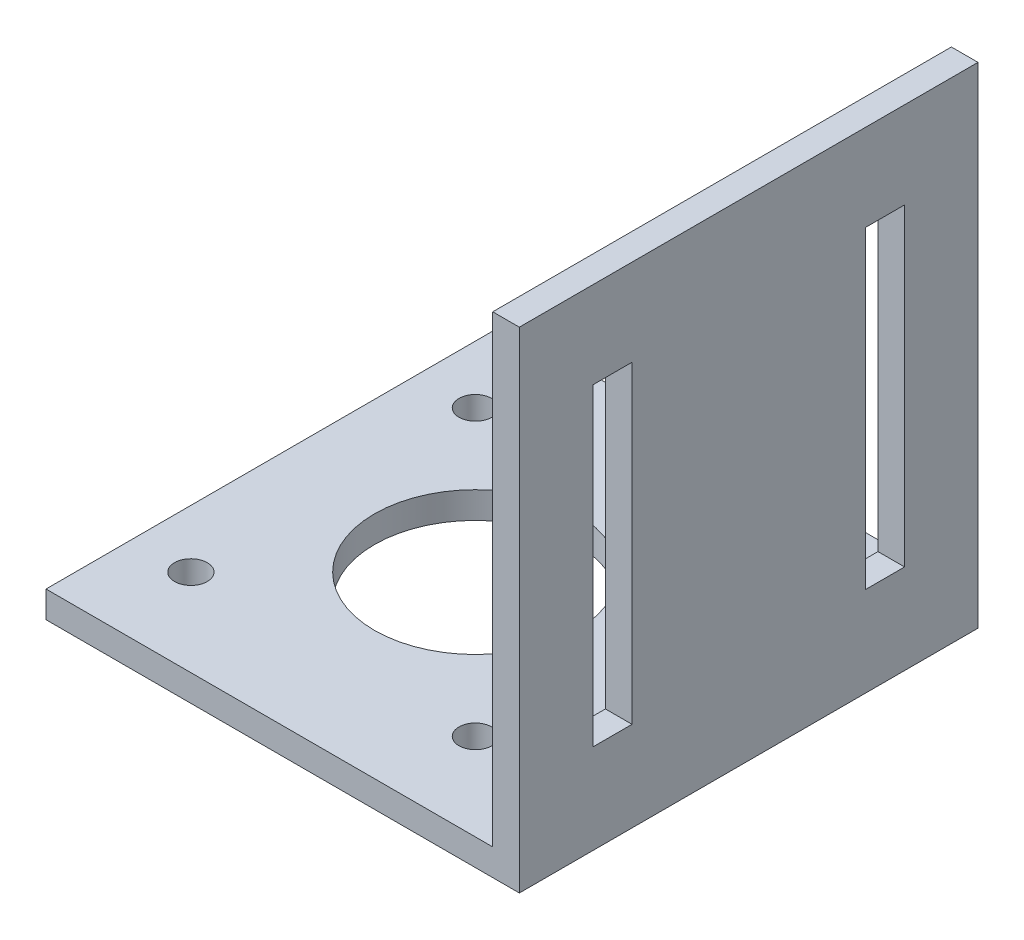
ISO-10303-21;
HEADER;
FILE_DESCRIPTION(('STEP AP214'),'2;1');
FILE_NAME('part.step','',(''),(''),'','','');
FILE_SCHEMA(('AUTOMOTIVE_DESIGN { 1 0 10303 214 1 1 1 1 }'));
ENDSEC;
DATA;
#1=APPLICATION_CONTEXT('core data for automotive mechanical design processes');
#2=APPLICATION_PROTOCOL_DEFINITION('international standard','automotive_design',2000,#1);
#3=PRODUCT_CONTEXT('',#1,'mechanical');
#4=PRODUCT('Part','Part','',(#3));
#5=PRODUCT_RELATED_PRODUCT_CATEGORY('part','',(#4));
#6=PRODUCT_DEFINITION_FORMATION('','',#4);
#7=PRODUCT_DEFINITION_CONTEXT('part definition',#1,'design');
#8=PRODUCT_DEFINITION('design','',#6,#7);
#9=PRODUCT_DEFINITION_SHAPE('','',#8);
#10=(LENGTH_UNIT() NAMED_UNIT(*) SI_UNIT(.MILLI.,.METRE.));
#11=(NAMED_UNIT(*) PLANE_ANGLE_UNIT() SI_UNIT($,.RADIAN.));
#12=(NAMED_UNIT(*) SI_UNIT($,.STERADIAN.) SOLID_ANGLE_UNIT());
#13=UNCERTAINTY_MEASURE_WITH_UNIT(LENGTH_MEASURE(1.E-05),#10,'distance_accuracy_value','');
#14=(GEOMETRIC_REPRESENTATION_CONTEXT(3) GLOBAL_UNCERTAINTY_ASSIGNED_CONTEXT((#13)) GLOBAL_UNIT_ASSIGNED_CONTEXT((#10,
#11,#12)) REPRESENTATION_CONTEXT('',''));
#15=CARTESIAN_POINT('',(0.,0.,0.));
#16=DIRECTION('',(0.,0.,1.));
#17=DIRECTION('',(1.,0.,0.));
#18=AXIS2_PLACEMENT_3D('',#15,#16,#17);
#19=CARTESIAN_POINT('',(0.,2.9,0.));
#20=DIRECTION('',(0.,-1.,0.));
#21=DIRECTION('',(0.,0.,-1.));
#22=AXIS2_PLACEMENT_3D('',#19,#20,#21);
#23=PLANE('',#22);
#24=CARTESIAN_POINT('',(6.3,2.9,-9.49));
#25=DIRECTION('',(0.,-1.,0.));
#26=DIRECTION('',(0.,0.,-1.));
#27=AXIS2_PLACEMENT_3D('',#24,#25,#26);
#28=CIRCLE('',#27,1.785);
#29=CARTESIAN_POINT('',(6.3,2.9,-11.275));
#30=VERTEX_POINT('',#29);
#31=EDGE_CURVE('E169',#30,#30,#28,.T.);
#32=ORIENTED_EDGE('',*,*,#31,.T.);
#33=EDGE_LOOP('',(#32));
#34=FACE_BOUND('',#33,.T.);
#35=CARTESIAN_POINT('',(37.3,2.9,-9.49));
#36=DIRECTION('',(0.,-1.,0.));
#37=DIRECTION('',(0.,0.,-1.));
#38=AXIS2_PLACEMENT_3D('',#35,#36,#37);
#39=CIRCLE('',#38,1.785);
#40=CARTESIAN_POINT('',(37.3,2.9,-11.275));
#41=VERTEX_POINT('',#40);
#42=EDGE_CURVE('E439',#41,#41,#39,.T.);
#43=ORIENTED_EDGE('',*,*,#42,.T.);
#44=EDGE_LOOP('',(#43));
#45=FACE_BOUND('',#44,.T.);
#46=CARTESIAN_POINT('',(37.3,2.9,-40.49));
#47=DIRECTION('',(0.,-1.,0.));
#48=DIRECTION('',(0.,0.,-1.));
#49=AXIS2_PLACEMENT_3D('',#46,#47,#48);
#50=CIRCLE('',#49,1.785);
#51=CARTESIAN_POINT('',(37.3,2.9,-42.275));
#52=VERTEX_POINT('',#51);
#53=EDGE_CURVE('E442',#52,#52,#50,.T.);
#54=ORIENTED_EDGE('',*,*,#53,.T.);
#55=EDGE_LOOP('',(#54));
#56=FACE_BOUND('',#55,.T.);
#57=CARTESIAN_POINT('',(6.3,2.9,-40.49));
#58=DIRECTION('',(0.,-1.,0.));
#59=DIRECTION('',(0.,0.,-1.));
#60=AXIS2_PLACEMENT_3D('',#57,#58,#59);
#61=CIRCLE('',#60,1.785);
#62=CARTESIAN_POINT('',(6.3,2.9,-42.275));
#63=VERTEX_POINT('',#62);
#64=EDGE_CURVE('E447',#63,#63,#61,.T.);
#65=ORIENTED_EDGE('',*,*,#64,.T.);
#66=EDGE_LOOP('',(#65));
#67=FACE_BOUND('',#66,.T.);
#68=CARTESIAN_POINT('',(21.8,2.9,-24.99));
#69=DIRECTION('',(0.,-1.,0.));
#70=DIRECTION('',(0.,0.,-1.));
#71=AXIS2_PLACEMENT_3D('',#68,#69,#70);
#72=CIRCLE('',#71,11.);
#73=CARTESIAN_POINT('',(21.8,2.9,-35.99));
#74=VERTEX_POINT('',#73);
#75=EDGE_CURVE('E450',#74,#74,#72,.T.);
#76=ORIENTED_EDGE('',*,*,#75,.T.);
#77=EDGE_LOOP('',(#76));
#78=FACE_BOUND('',#77,.T.);
#79=DIRECTION('',(0.,0.,1.));
#80=VECTOR('',#79,1.);
#81=CARTESIAN_POINT('',(48.68,2.9,0.));
#82=LINE('',#81,#80);
#83=CARTESIAN_POINT('',(48.68,2.9,-49.98));
#84=VERTEX_POINT('',#83);
#85=CARTESIAN_POINT('',(48.68,2.9,0.));
#86=VERTEX_POINT('',#85);
#87=EDGE_CURVE('E164',#84,#86,#82,.T.);
#88=ORIENTED_EDGE('',*,*,#87,.F.);
#89=DIRECTION('',(-1.,0.,0.));
#90=VECTOR('',#89,1.);
#91=CARTESIAN_POINT('',(0.,2.9,-49.98));
#92=LINE('',#91,#90);
#93=CARTESIAN_POINT('',(0.,2.9,-49.98));
#94=VERTEX_POINT('',#93);
#95=EDGE_CURVE('E211',#84,#94,#92,.T.);
#96=ORIENTED_EDGE('',*,*,#95,.T.);
#97=DIRECTION('',(0.,0.,1.));
#98=VECTOR('',#97,1.);
#99=CARTESIAN_POINT('',(0.,2.9,0.));
#100=LINE('',#99,#98);
#101=CARTESIAN_POINT('',(0.,2.9,0.));
#102=VERTEX_POINT('',#101);
#103=EDGE_CURVE('E205',#94,#102,#100,.T.);
#104=ORIENTED_EDGE('',*,*,#103,.T.);
#105=DIRECTION('',(1.,0.,0.));
#106=VECTOR('',#105,1.);
#107=CARTESIAN_POINT('',(0.,2.9,0.));
#108=LINE('',#107,#106);
#109=EDGE_CURVE('E208',#102,#86,#108,.T.);
#110=ORIENTED_EDGE('',*,*,#109,.T.);
#111=EDGE_LOOP('',(#88,#96,#104,#110));
#112=FACE_BOUND('',#111,.T.);
#113=ADVANCED_FACE('F32',(#34,#45,#56,#67,#78,#112),#23,.F.);
#114=CARTESIAN_POINT('',(0.,2.9,0.));
#115=DIRECTION('',(1.,0.,0.));
#116=DIRECTION('',(0.,0.,-1.));
#117=AXIS2_PLACEMENT_3D('',#114,#115,#116);
#118=PLANE('',#117);
#119=DIRECTION('',(0.,0.,1.));
#120=VECTOR('',#119,1.);
#121=CARTESIAN_POINT('',(0.,0.,0.));
#122=LINE('',#121,#120);
#123=CARTESIAN_POINT('',(0.,0.,-49.98));
#124=VERTEX_POINT('',#123);
#125=CARTESIAN_POINT('',(0.,0.,0.));
#126=VERTEX_POINT('',#125);
#127=EDGE_CURVE('E204',#124,#126,#122,.T.);
#128=ORIENTED_EDGE('',*,*,#127,.T.);
#129=DIRECTION('',(0.,-1.,0.));
#130=VECTOR('',#129,1.);
#131=CARTESIAN_POINT('',(0.,2.9,0.));
#132=LINE('',#131,#130);
#133=EDGE_CURVE('E229',#102,#126,#132,.T.);
#134=ORIENTED_EDGE('',*,*,#133,.F.);
#135=ORIENTED_EDGE('',*,*,#103,.F.);
#136=DIRECTION('',(0.,-1.,0.));
#137=VECTOR('',#136,1.);
#138=CARTESIAN_POINT('',(0.,2.9,-49.98));
#139=LINE('',#138,#137);
#140=EDGE_CURVE('E213',#94,#124,#139,.T.);
#141=ORIENTED_EDGE('',*,*,#140,.T.);
#142=EDGE_LOOP('',(#128,#134,#135,#141));
#143=FACE_BOUND('',#142,.T.);
#144=ADVANCED_FACE('F34',(#143),#118,.F.);
#145=CARTESIAN_POINT('',(0.,2.9,0.));
#146=DIRECTION('',(0.,0.,-1.));
#147=DIRECTION('',(-1.,0.,0.));
#148=AXIS2_PLACEMENT_3D('',#145,#146,#147);
#149=PLANE('',#148);
#150=DIRECTION('',(1.,0.,0.));
#151=VECTOR('',#150,1.);
#152=CARTESIAN_POINT('',(0.,0.,0.));
#153=LINE('',#152,#151);
#154=CARTESIAN_POINT('',(51.58,0.,0.));
#155=VERTEX_POINT('',#154);
#156=EDGE_CURVE('E216',#126,#155,#153,.T.);
#157=ORIENTED_EDGE('',*,*,#156,.T.);
#158=DIRECTION('',(0.,-1.,0.));
#159=VECTOR('',#158,1.);
#160=CARTESIAN_POINT('',(51.58,2.9,0.));
#161=LINE('',#160,#159);
#162=CARTESIAN_POINT('',(51.58,53.4,0.));
#163=VERTEX_POINT('',#162);
#164=EDGE_CURVE('E226',#163,#155,#161,.T.);
#165=ORIENTED_EDGE('',*,*,#164,.F.);
#166=DIRECTION('',(1.,0.,0.));
#167=VECTOR('',#166,1.);
#168=CARTESIAN_POINT('',(51.58,53.4,0.));
#169=LINE('',#168,#167);
#170=CARTESIAN_POINT('',(48.68,53.4,0.));
#171=VERTEX_POINT('',#170);
#172=EDGE_CURVE('E193',#171,#163,#169,.T.);
#173=ORIENTED_EDGE('',*,*,#172,.F.);
#174=DIRECTION('',(0.,-1.,0.));
#175=VECTOR('',#174,1.);
#176=CARTESIAN_POINT('',(48.68,53.4,0.));
#177=LINE('',#176,#175);
#178=EDGE_CURVE('E196',#171,#86,#177,.T.);
#179=ORIENTED_EDGE('',*,*,#178,.T.);
#180=ORIENTED_EDGE('',*,*,#109,.F.);
#181=ORIENTED_EDGE('',*,*,#133,.T.);
#182=EDGE_LOOP('',(#157,#165,#173,#179,#180,#181));
#183=FACE_BOUND('',#182,.T.);
#184=ADVANCED_FACE('F273',(#183),#149,.F.);
#185=CARTESIAN_POINT('',(51.58,2.9,0.));
#186=DIRECTION('',(-1.,0.,0.));
#187=DIRECTION('',(0.,0.,1.));
#188=AXIS2_PLACEMENT_3D('',#185,#186,#187);
#189=PLANE('',#188);
#190=DIRECTION('',(0.,0.,-1.));
#191=VECTOR('',#190,1.);
#192=CARTESIAN_POINT('',(51.58,9.78,-8.00000000000001));
#193=LINE('',#192,#191);
#194=CARTESIAN_POINT('',(51.58,9.78,-7.99999999999999));
#195=VERTEX_POINT('',#194);
#196=CARTESIAN_POINT('',(51.58,9.78,-12.28));
#197=VERTEX_POINT('',#196);
#198=EDGE_CURVE('E150',#195,#197,#193,.T.);
#199=ORIENTED_EDGE('',*,*,#198,.F.);
#200=DIRECTION('',(0.,-1.,0.));
#201=VECTOR('',#200,1.);
#202=CARTESIAN_POINT('',(51.58,43.95,-8.));
#203=LINE('',#202,#201);
#204=CARTESIAN_POINT('',(51.58,43.95,-8.));
#205=VERTEX_POINT('',#204);
#206=EDGE_CURVE('E47',#205,#195,#203,.T.);
#207=ORIENTED_EDGE('',*,*,#206,.F.);
#208=DIRECTION('',(0.,0.,1.));
#209=VECTOR('',#208,1.);
#210=CARTESIAN_POINT('',(51.58,43.95,-8.));
#211=LINE('',#210,#209);
#212=CARTESIAN_POINT('',(51.58,43.95,-12.28));
#213=VERTEX_POINT('',#212);
#214=EDGE_CURVE('E157',#213,#205,#211,.T.);
#215=ORIENTED_EDGE('',*,*,#214,.F.);
#216=DIRECTION('',(0.,1.,0.));
#217=VECTOR('',#216,1.);
#218=CARTESIAN_POINT('',(51.58,43.95,-12.28));
#219=LINE('',#218,#217);
#220=EDGE_CURVE('E140',#197,#213,#219,.T.);
#221=ORIENTED_EDGE('',*,*,#220,.F.);
#222=EDGE_LOOP('',(#199,#207,#215,#221));
#223=FACE_BOUND('',#222,.T.);
#224=DIRECTION('',(0.,0.,-1.));
#225=VECTOR('',#224,1.);
#226=CARTESIAN_POINT('',(51.58,9.78,-37.7));
#227=LINE('',#226,#225);
#228=CARTESIAN_POINT('',(51.58,9.78,-37.7));
#229=VERTEX_POINT('',#228);
#230=CARTESIAN_POINT('',(51.58,9.78,-41.98));
#231=VERTEX_POINT('',#230);
#232=EDGE_CURVE('E168',#229,#231,#227,.T.);
#233=ORIENTED_EDGE('',*,*,#232,.F.);
#234=DIRECTION('',(0.,-1.,0.));
#235=VECTOR('',#234,1.);
#236=CARTESIAN_POINT('',(51.58,43.95,-37.7));
#237=LINE('',#236,#235);
#238=CARTESIAN_POINT('',(51.58,43.95,-37.7));
#239=VERTEX_POINT('',#238);
#240=EDGE_CURVE('E55',#239,#229,#237,.T.);
#241=ORIENTED_EDGE('',*,*,#240,.F.);
#242=DIRECTION('',(0.,0.,1.));
#243=VECTOR('',#242,1.);
#244=CARTESIAN_POINT('',(51.58,43.95,-37.7));
#245=LINE('',#244,#243);
#246=CARTESIAN_POINT('',(51.58,43.95,-41.98));
#247=VERTEX_POINT('',#246);
#248=EDGE_CURVE('E175',#247,#239,#245,.T.);
#249=ORIENTED_EDGE('',*,*,#248,.F.);
#250=DIRECTION('',(0.,1.,0.));
#251=VECTOR('',#250,1.);
#252=CARTESIAN_POINT('',(51.58,43.95,-41.98));
#253=LINE('',#252,#251);
#254=EDGE_CURVE('E172',#231,#247,#253,.T.);
#255=ORIENTED_EDGE('',*,*,#254,.F.);
#256=EDGE_LOOP('',(#233,#241,#249,#255));
#257=FACE_BOUND('',#256,.T.);
#258=DIRECTION('',(0.,0.,-1.));
#259=VECTOR('',#258,1.);
#260=CARTESIAN_POINT('',(51.58,0.,0.));
#261=LINE('',#260,#259);
#262=CARTESIAN_POINT('',(51.58,0.,-49.98));
#263=VERTEX_POINT('',#262);
#264=EDGE_CURVE('E218',#155,#263,#261,.T.);
#265=ORIENTED_EDGE('',*,*,#264,.T.);
#266=DIRECTION('',(0.,-1.,0.));
#267=VECTOR('',#266,1.);
#268=CARTESIAN_POINT('',(51.58,2.9,-49.98));
#269=LINE('',#268,#267);
#270=CARTESIAN_POINT('',(51.58,53.4,-49.98));
#271=VERTEX_POINT('',#270);
#272=EDGE_CURVE('E223',#271,#263,#269,.T.);
#273=ORIENTED_EDGE('',*,*,#272,.F.);
#274=DIRECTION('',(0.,0.,-1.));
#275=VECTOR('',#274,1.);
#276=CARTESIAN_POINT('',(51.58,53.4,0.));
#277=LINE('',#276,#275);
#278=EDGE_CURVE('E186',#163,#271,#277,.T.);
#279=ORIENTED_EDGE('',*,*,#278,.F.);
#280=ORIENTED_EDGE('',*,*,#164,.T.);
#281=EDGE_LOOP('',(#265,#273,#279,#280));
#282=FACE_BOUND('',#281,.T.);
#283=ADVANCED_FACE('F154',(#223,#257,#282),#189,.F.);
#284=CARTESIAN_POINT('',(0.,2.9,-49.98));
#285=DIRECTION('',(0.,0.,1.));
#286=DIRECTION('',(1.,0.,0.));
#287=AXIS2_PLACEMENT_3D('',#284,#285,#286);
#288=PLANE('',#287);
#289=DIRECTION('',(-1.,0.,0.));
#290=VECTOR('',#289,1.);
#291=CARTESIAN_POINT('',(0.,0.,-49.98));
#292=LINE('',#291,#290);
#293=EDGE_CURVE('E209',#263,#124,#292,.T.);
#294=ORIENTED_EDGE('',*,*,#293,.T.);
#295=ORIENTED_EDGE('',*,*,#140,.F.);
#296=ORIENTED_EDGE('',*,*,#95,.F.);
#297=DIRECTION('',(0.,-1.,0.));
#298=VECTOR('',#297,1.);
#299=CARTESIAN_POINT('',(48.68,53.4,-49.98));
#300=LINE('',#299,#298);
#301=CARTESIAN_POINT('',(48.68,53.4,-49.98));
#302=VERTEX_POINT('',#301);
#303=EDGE_CURVE('E201',#302,#84,#300,.T.);
#304=ORIENTED_EDGE('',*,*,#303,.F.);
#305=DIRECTION('',(-1.,0.,0.));
#306=VECTOR('',#305,1.);
#307=CARTESIAN_POINT('',(51.58,53.4,-49.98));
#308=LINE('',#307,#306);
#309=EDGE_CURVE('E189',#271,#302,#308,.T.);
#310=ORIENTED_EDGE('',*,*,#309,.F.);
#311=ORIENTED_EDGE('',*,*,#272,.T.);
#312=EDGE_LOOP('',(#294,#295,#296,#304,#310,#311));
#313=FACE_BOUND('',#312,.T.);
#314=ADVANCED_FACE('F283',(#313),#288,.F.);
#315=CARTESIAN_POINT('',(0.,0.,0.));
#316=DIRECTION('',(0.,-1.,0.));
#317=DIRECTION('',(0.,0.,-1.));
#318=AXIS2_PLACEMENT_3D('',#315,#316,#317);
#319=PLANE('',#318);
#320=CARTESIAN_POINT('',(6.3,0.,-9.49));
#321=DIRECTION('',(0.,-1.,0.));
#322=DIRECTION('',(0.,0.,1.));
#323=AXIS2_PLACEMENT_3D('',#320,#321,#322);
#324=CIRCLE('',#323,1.785);
#325=CARTESIAN_POINT('',(6.3,0.,-7.705));
#326=VERTEX_POINT('',#325);
#327=EDGE_CURVE('E437',#326,#326,#324,.T.);
#328=ORIENTED_EDGE('',*,*,#327,.F.);
#329=EDGE_LOOP('',(#328));
#330=FACE_BOUND('',#329,.T.);
#331=CARTESIAN_POINT('',(37.3,0.,-9.49));
#332=DIRECTION('',(0.,-1.,0.));
#333=DIRECTION('',(0.,0.,-1.));
#334=AXIS2_PLACEMENT_3D('',#331,#332,#333);
#335=CIRCLE('',#334,1.785);
#336=CARTESIAN_POINT('',(37.3,0.,-11.275));
#337=VERTEX_POINT('',#336);
#338=EDGE_CURVE('E458',#337,#337,#335,.T.);
#339=ORIENTED_EDGE('',*,*,#338,.F.);
#340=EDGE_LOOP('',(#339));
#341=FACE_BOUND('',#340,.T.);
#342=CARTESIAN_POINT('',(37.3,0.,-40.49));
#343=DIRECTION('',(0.,-1.,0.));
#344=DIRECTION('',(0.,0.,1.));
#345=AXIS2_PLACEMENT_3D('',#342,#343,#344);
#346=CIRCLE('',#345,1.785);
#347=CARTESIAN_POINT('',(37.3,0.,-38.705));
#348=VERTEX_POINT('',#347);
#349=EDGE_CURVE('E461',#348,#348,#346,.T.);
#350=ORIENTED_EDGE('',*,*,#349,.F.);
#351=EDGE_LOOP('',(#350));
#352=FACE_BOUND('',#351,.T.);
#353=CARTESIAN_POINT('',(6.3,0.,-40.49));
#354=DIRECTION('',(0.,-1.,0.));
#355=DIRECTION('',(0.,0.,-1.));
#356=AXIS2_PLACEMENT_3D('',#353,#354,#355);
#357=CIRCLE('',#356,1.785);
#358=CARTESIAN_POINT('',(6.3,0.,-42.275));
#359=VERTEX_POINT('',#358);
#360=EDGE_CURVE('E456',#359,#359,#357,.T.);
#361=ORIENTED_EDGE('',*,*,#360,.F.);
#362=EDGE_LOOP('',(#361));
#363=FACE_BOUND('',#362,.T.);
#364=CARTESIAN_POINT('',(21.8,0.,-24.99));
#365=DIRECTION('',(0.,-1.,0.));
#366=DIRECTION('',(0.,0.,-1.));
#367=AXIS2_PLACEMENT_3D('',#364,#365,#366);
#368=CIRCLE('',#367,11.);
#369=CARTESIAN_POINT('',(21.8,0.,-35.99));
#370=VERTEX_POINT('',#369);
#371=EDGE_CURVE('E453',#370,#370,#368,.T.);
#372=ORIENTED_EDGE('',*,*,#371,.F.);
#373=EDGE_LOOP('',(#372));
#374=FACE_BOUND('',#373,.T.);
#375=ORIENTED_EDGE('',*,*,#127,.F.);
#376=ORIENTED_EDGE('',*,*,#293,.F.);
#377=ORIENTED_EDGE('',*,*,#264,.F.);
#378=ORIENTED_EDGE('',*,*,#156,.F.);
#379=EDGE_LOOP('',(#375,#376,#377,#378));
#380=FACE_BOUND('',#379,.T.);
#381=ADVANCED_FACE('F280',(#330,#341,#352,#363,#374,#380),#319,.T.);
#382=CARTESIAN_POINT('',(48.68,53.4,0.));
#383=DIRECTION('',(1.,0.,0.));
#384=DIRECTION('',(0.,0.,-1.));
#385=AXIS2_PLACEMENT_3D('',#382,#383,#384);
#386=PLANE('',#385);
#387=DIRECTION('',(0.,0.,1.));
#388=VECTOR('',#387,1.);
#389=CARTESIAN_POINT('',(48.68,43.95,0.));
#390=LINE('',#389,#388);
#391=CARTESIAN_POINT('',(48.68,43.95,-12.28));
#392=VERTEX_POINT('',#391);
#393=CARTESIAN_POINT('',(48.68,43.95,-8.));
#394=VERTEX_POINT('',#393);
#395=EDGE_CURVE('E40',#392,#394,#390,.T.);
#396=ORIENTED_EDGE('',*,*,#395,.T.);
#397=DIRECTION('',(0.,-1.,0.));
#398=VECTOR('',#397,1.);
#399=CARTESIAN_POINT('',(48.68,53.4,-8.));
#400=LINE('',#399,#398);
#401=CARTESIAN_POINT('',(48.68,9.78,-8.00000000000001));
#402=VERTEX_POINT('',#401);
#403=EDGE_CURVE('E11',#394,#402,#400,.T.);
#404=ORIENTED_EDGE('',*,*,#403,.T.);
#405=DIRECTION('',(0.,0.,-1.));
#406=VECTOR('',#405,1.);
#407=CARTESIAN_POINT('',(48.68,9.78,0.));
#408=LINE('',#407,#406);
#409=CARTESIAN_POINT('',(48.68,9.78,-12.28));
#410=VERTEX_POINT('',#409);
#411=EDGE_CURVE('E244',#402,#410,#408,.T.);
#412=ORIENTED_EDGE('',*,*,#411,.T.);
#413=DIRECTION('',(0.,1.,0.));
#414=VECTOR('',#413,1.);
#415=CARTESIAN_POINT('',(48.68,53.4,-12.28));
#416=LINE('',#415,#414);
#417=EDGE_CURVE('E143',#410,#392,#416,.T.);
#418=ORIENTED_EDGE('',*,*,#417,.T.);
#419=EDGE_LOOP('',(#396,#404,#412,#418));
#420=FACE_BOUND('',#419,.T.);
#421=DIRECTION('',(0.,0.,1.));
#422=VECTOR('',#421,1.);
#423=CARTESIAN_POINT('',(48.68,43.95,0.));
#424=LINE('',#423,#422);
#425=CARTESIAN_POINT('',(48.68,43.95,-41.98));
#426=VERTEX_POINT('',#425);
#427=CARTESIAN_POINT('',(48.68,43.95,-37.7));
#428=VERTEX_POINT('',#427);
#429=EDGE_CURVE('E238',#426,#428,#424,.T.);
#430=ORIENTED_EDGE('',*,*,#429,.T.);
#431=DIRECTION('',(0.,-1.,0.));
#432=VECTOR('',#431,1.);
#433=CARTESIAN_POINT('',(48.68,53.4,-37.7));
#434=LINE('',#433,#432);
#435=CARTESIAN_POINT('',(48.68,9.78,-37.7));
#436=VERTEX_POINT('',#435);
#437=EDGE_CURVE('E241',#428,#436,#434,.T.);
#438=ORIENTED_EDGE('',*,*,#437,.T.);
#439=DIRECTION('',(0.,0.,-1.));
#440=VECTOR('',#439,1.);
#441=CARTESIAN_POINT('',(48.68,9.78,0.));
#442=LINE('',#441,#440);
#443=CARTESIAN_POINT('',(48.68,9.78,-41.98));
#444=VERTEX_POINT('',#443);
#445=EDGE_CURVE('E232',#436,#444,#442,.T.);
#446=ORIENTED_EDGE('',*,*,#445,.T.);
#447=DIRECTION('',(0.,1.,0.));
#448=VECTOR('',#447,1.);
#449=CARTESIAN_POINT('',(48.68,53.4,-41.98));
#450=LINE('',#449,#448);
#451=EDGE_CURVE('E235',#444,#426,#450,.T.);
#452=ORIENTED_EDGE('',*,*,#451,.T.);
#453=EDGE_LOOP('',(#430,#438,#446,#452));
#454=FACE_BOUND('',#453,.T.);
#455=ORIENTED_EDGE('',*,*,#87,.T.);
#456=ORIENTED_EDGE('',*,*,#178,.F.);
#457=DIRECTION('',(0.,0.,1.));
#458=VECTOR('',#457,1.);
#459=CARTESIAN_POINT('',(48.68,53.4,0.));
#460=LINE('',#459,#458);
#461=EDGE_CURVE('E191',#302,#171,#460,.T.);
#462=ORIENTED_EDGE('',*,*,#461,.F.);
#463=ORIENTED_EDGE('',*,*,#303,.T.);
#464=EDGE_LOOP('',(#455,#456,#462,#463));
#465=FACE_BOUND('',#464,.T.);
#466=ADVANCED_FACE('F248',(#420,#454,#465),#386,.F.);
#467=CARTESIAN_POINT('',(0.,53.4,0.));
#468=DIRECTION('',(0.,1.,0.));
#469=DIRECTION('',(0.,0.,1.));
#470=AXIS2_PLACEMENT_3D('',#467,#468,#469);
#471=PLANE('',#470);
#472=ORIENTED_EDGE('',*,*,#278,.T.);
#473=ORIENTED_EDGE('',*,*,#309,.T.);
#474=ORIENTED_EDGE('',*,*,#461,.T.);
#475=ORIENTED_EDGE('',*,*,#172,.T.);
#476=EDGE_LOOP('',(#472,#473,#474,#475));
#477=FACE_BOUND('',#476,.T.);
#478=ADVANCED_FACE('F311',(#477),#471,.T.);
#479=CARTESIAN_POINT('',(0.,43.95,-37.7));
#480=DIRECTION('',(0.,0.,1.));
#481=DIRECTION('',(1.,0.,0.));
#482=AXIS2_PLACEMENT_3D('',#479,#480,#481);
#483=PLANE('',#482);
#484=DIRECTION('',(1.,0.,0.));
#485=VECTOR('',#484,1.);
#486=CARTESIAN_POINT('',(0.,43.95,-37.7));
#487=LINE('',#486,#485);
#488=EDGE_CURVE('E179',#428,#239,#487,.T.);
#489=ORIENTED_EDGE('',*,*,#488,.T.);
#490=ORIENTED_EDGE('',*,*,#240,.T.);
#491=DIRECTION('',(1.,0.,0.));
#492=VECTOR('',#491,1.);
#493=CARTESIAN_POINT('',(0.,9.78,-37.7));
#494=LINE('',#493,#492);
#495=EDGE_CURVE('E178',#436,#229,#494,.T.);
#496=ORIENTED_EDGE('',*,*,#495,.F.);
#497=ORIENTED_EDGE('',*,*,#437,.F.);
#498=EDGE_LOOP('',(#489,#490,#496,#497));
#499=FACE_BOUND('',#498,.T.);
#500=ADVANCED_FACE('F313',(#499),#483,.F.);
#501=CARTESIAN_POINT('',(0.,43.95,-37.7));
#502=DIRECTION('',(0.,1.,0.));
#503=DIRECTION('',(0.,0.,1.));
#504=AXIS2_PLACEMENT_3D('',#501,#502,#503);
#505=PLANE('',#504);
#506=DIRECTION('',(1.,0.,0.));
#507=VECTOR('',#506,1.);
#508=CARTESIAN_POINT('',(0.,43.95,-41.98));
#509=LINE('',#508,#507);
#510=EDGE_CURVE('E181',#426,#247,#509,.T.);
#511=ORIENTED_EDGE('',*,*,#510,.T.);
#512=ORIENTED_EDGE('',*,*,#248,.T.);
#513=ORIENTED_EDGE('',*,*,#488,.F.);
#514=ORIENTED_EDGE('',*,*,#429,.F.);
#515=EDGE_LOOP('',(#511,#512,#513,#514));
#516=FACE_BOUND('',#515,.T.);
#517=ADVANCED_FACE('F318',(#516),#505,.F.);
#518=CARTESIAN_POINT('',(0.,43.95,-41.98));
#519=DIRECTION('',(0.,0.,-1.));
#520=DIRECTION('',(-1.,0.,0.));
#521=AXIS2_PLACEMENT_3D('',#518,#519,#520);
#522=PLANE('',#521);
#523=DIRECTION('',(1.,0.,0.));
#524=VECTOR('',#523,1.);
#525=CARTESIAN_POINT('',(0.,9.78,-41.98));
#526=LINE('',#525,#524);
#527=EDGE_CURVE('E183',#444,#231,#526,.T.);
#528=ORIENTED_EDGE('',*,*,#527,.T.);
#529=ORIENTED_EDGE('',*,*,#254,.T.);
#530=ORIENTED_EDGE('',*,*,#510,.F.);
#531=ORIENTED_EDGE('',*,*,#451,.F.);
#532=EDGE_LOOP('',(#528,#529,#530,#531));
#533=FACE_BOUND('',#532,.T.);
#534=ADVANCED_FACE('F262',(#533),#522,.F.);
#535=CARTESIAN_POINT('',(0.,9.78,-37.7));
#536=DIRECTION('',(0.,-1.,0.));
#537=DIRECTION('',(0.,0.,-1.));
#538=AXIS2_PLACEMENT_3D('',#535,#536,#537);
#539=PLANE('',#538);
#540=ORIENTED_EDGE('',*,*,#495,.T.);
#541=ORIENTED_EDGE('',*,*,#232,.T.);
#542=ORIENTED_EDGE('',*,*,#527,.F.);
#543=ORIENTED_EDGE('',*,*,#445,.F.);
#544=EDGE_LOOP('',(#540,#541,#542,#543));
#545=FACE_BOUND('',#544,.T.);
#546=ADVANCED_FACE('F255',(#545),#539,.F.);
#547=CARTESIAN_POINT('',(0.,43.95,-7.99999999999999));
#548=DIRECTION('',(0.,0.,1.));
#549=DIRECTION('',(1.,0.,0.));
#550=AXIS2_PLACEMENT_3D('',#547,#548,#549);
#551=PLANE('',#550);
#552=DIRECTION('',(1.,0.,0.));
#553=VECTOR('',#552,1.);
#554=CARTESIAN_POINT('',(0.,43.95,-7.99999999999999));
#555=LINE('',#554,#553);
#556=EDGE_CURVE('E162',#394,#205,#555,.T.);
#557=ORIENTED_EDGE('',*,*,#556,.T.);
#558=ORIENTED_EDGE('',*,*,#206,.T.);
#559=DIRECTION('',(1.,0.,0.));
#560=VECTOR('',#559,1.);
#561=CARTESIAN_POINT('',(0.,9.78,-7.99999999999999));
#562=LINE('',#561,#560);
#563=EDGE_CURVE('E147',#402,#195,#562,.T.);
#564=ORIENTED_EDGE('',*,*,#563,.F.);
#565=ORIENTED_EDGE('',*,*,#403,.F.);
#566=EDGE_LOOP('',(#557,#558,#564,#565));
#567=FACE_BOUND('',#566,.T.);
#568=ADVANCED_FACE('F253',(#567),#551,.F.);
#569=CARTESIAN_POINT('',(0.,43.95,-7.99999999999999));
#570=DIRECTION('',(0.,1.,0.));
#571=DIRECTION('',(0.,0.,1.));
#572=AXIS2_PLACEMENT_3D('',#569,#570,#571);
#573=PLANE('',#572);
#574=DIRECTION('',(1.,0.,0.));
#575=VECTOR('',#574,1.);
#576=CARTESIAN_POINT('',(0.,43.95,-12.28));
#577=LINE('',#576,#575);
#578=EDGE_CURVE('E146',#392,#213,#577,.T.);
#579=ORIENTED_EDGE('',*,*,#578,.T.);
#580=ORIENTED_EDGE('',*,*,#214,.T.);
#581=ORIENTED_EDGE('',*,*,#556,.F.);
#582=ORIENTED_EDGE('',*,*,#395,.F.);
#583=EDGE_LOOP('',(#579,#580,#581,#582));
#584=FACE_BOUND('',#583,.T.);
#585=ADVANCED_FACE('F252',(#584),#573,.F.);
#586=CARTESIAN_POINT('',(0.,43.95,-12.28));
#587=DIRECTION('',(0.,0.,-1.));
#588=DIRECTION('',(-1.,0.,0.));
#589=AXIS2_PLACEMENT_3D('',#586,#587,#588);
#590=PLANE('',#589);
#591=DIRECTION('',(1.,0.,0.));
#592=VECTOR('',#591,1.);
#593=CARTESIAN_POINT('',(0.,9.78,-12.28));
#594=LINE('',#593,#592);
#595=EDGE_CURVE('E135',#410,#197,#594,.T.);
#596=ORIENTED_EDGE('',*,*,#595,.T.);
#597=ORIENTED_EDGE('',*,*,#220,.T.);
#598=ORIENTED_EDGE('',*,*,#578,.F.);
#599=ORIENTED_EDGE('',*,*,#417,.F.);
#600=EDGE_LOOP('',(#596,#597,#598,#599));
#601=FACE_BOUND('',#600,.T.);
#602=ADVANCED_FACE('F137',(#601),#590,.F.);
#603=CARTESIAN_POINT('',(0.,9.78,-7.99999999999999));
#604=DIRECTION('',(0.,-1.,0.));
#605=DIRECTION('',(0.,0.,-1.));
#606=AXIS2_PLACEMENT_3D('',#603,#604,#605);
#607=PLANE('',#606);
#608=ORIENTED_EDGE('',*,*,#563,.T.);
#609=ORIENTED_EDGE('',*,*,#198,.T.);
#610=ORIENTED_EDGE('',*,*,#595,.F.);
#611=ORIENTED_EDGE('',*,*,#411,.F.);
#612=EDGE_LOOP('',(#608,#609,#610,#611));
#613=FACE_BOUND('',#612,.T.);
#614=ADVANCED_FACE('F151',(#613),#607,.F.);
#615=CARTESIAN_POINT('',(21.8,53.4,-24.99));
#616=DIRECTION('',(0.,-1.,0.));
#617=DIRECTION('',(0.,0.,-1.));
#618=AXIS2_PLACEMENT_3D('',#615,#616,#617);
#619=CYLINDRICAL_SURFACE('',#618,11.);
#620=ORIENTED_EDGE('',*,*,#371,.T.);
#621=EDGE_LOOP('',(#620));
#622=FACE_BOUND('',#621,.T.);
#623=ORIENTED_EDGE('',*,*,#75,.F.);
#624=EDGE_LOOP('',(#623));
#625=FACE_BOUND('',#624,.T.);
#626=ADVANCED_FACE('F369',(#622,#625),#619,.F.);
#627=CARTESIAN_POINT('',(6.3,53.4,-40.49));
#628=DIRECTION('',(0.,-1.,0.));
#629=DIRECTION('',(0.,0.,-1.));
#630=AXIS2_PLACEMENT_3D('',#627,#628,#629);
#631=CYLINDRICAL_SURFACE('',#630,1.785);
#632=ORIENTED_EDGE('',*,*,#360,.T.);
#633=EDGE_LOOP('',(#632));
#634=FACE_BOUND('',#633,.T.);
#635=ORIENTED_EDGE('',*,*,#64,.F.);
#636=EDGE_LOOP('',(#635));
#637=FACE_BOUND('',#636,.T.);
#638=ADVANCED_FACE('F390',(#634,#637),#631,.F.);
#639=CARTESIAN_POINT('',(37.3,53.4,-40.49));
#640=DIRECTION('',(0.,-1.,0.));
#641=DIRECTION('',(0.,0.,-1.));
#642=AXIS2_PLACEMENT_3D('',#639,#640,#641);
#643=CYLINDRICAL_SURFACE('',#642,1.785);
#644=ORIENTED_EDGE('',*,*,#349,.T.);
#645=EDGE_LOOP('',(#644));
#646=FACE_BOUND('',#645,.T.);
#647=ORIENTED_EDGE('',*,*,#53,.F.);
#648=EDGE_LOOP('',(#647));
#649=FACE_BOUND('',#648,.T.);
#650=ADVANCED_FACE('F400',(#646,#649),#643,.F.);
#651=CARTESIAN_POINT('',(37.3,53.4,-9.49));
#652=DIRECTION('',(0.,-1.,0.));
#653=DIRECTION('',(0.,0.,-1.));
#654=AXIS2_PLACEMENT_3D('',#651,#652,#653);
#655=CYLINDRICAL_SURFACE('',#654,1.785);
#656=ORIENTED_EDGE('',*,*,#338,.T.);
#657=EDGE_LOOP('',(#656));
#658=FACE_BOUND('',#657,.T.);
#659=ORIENTED_EDGE('',*,*,#42,.F.);
#660=EDGE_LOOP('',(#659));
#661=FACE_BOUND('',#660,.T.);
#662=ADVANCED_FACE('F410',(#658,#661),#655,.F.);
#663=CARTESIAN_POINT('',(6.3,53.4,-9.49));
#664=DIRECTION('',(0.,-1.,0.));
#665=DIRECTION('',(0.,0.,-1.));
#666=AXIS2_PLACEMENT_3D('',#663,#664,#665);
#667=CYLINDRICAL_SURFACE('',#666,1.785);
#668=ORIENTED_EDGE('',*,*,#327,.T.);
#669=EDGE_LOOP('',(#668));
#670=FACE_BOUND('',#669,.T.);
#671=ORIENTED_EDGE('',*,*,#31,.F.);
#672=EDGE_LOOP('',(#671));
#673=FACE_BOUND('',#672,.T.);
#674=ADVANCED_FACE('F420',(#670,#673),#667,.F.);
#675=CLOSED_SHELL('',(#113,#144,#184,#283,#314,#381,#466,#478,#500,#517,#534,#546,#568,#585,
#602,#614,#626,#638,#650,#662,#674));
#676=MANIFOLD_SOLID_BREP('B2',#675);
#677=ADVANCED_BREP_SHAPE_REPRESENTATION('',(#18,#676),#14);
#678=SHAPE_DEFINITION_REPRESENTATION(#9,#677);
ENDSEC;
END-ISO-10303-21;
